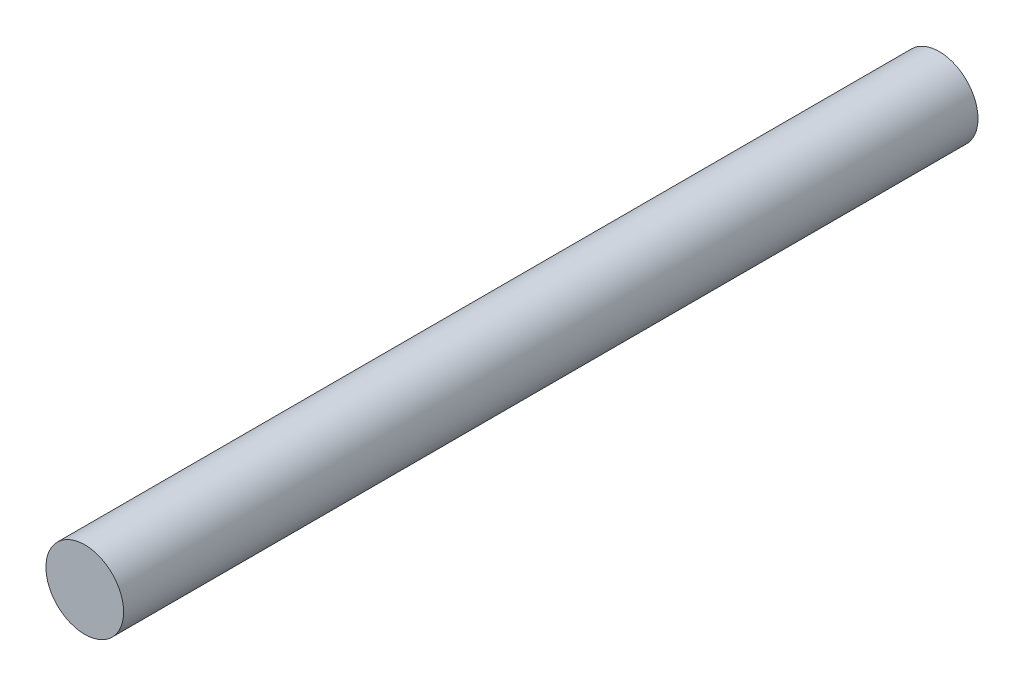
ISO-10303-21;
HEADER;
FILE_DESCRIPTION(('STEP AP214'),'2;1');
FILE_NAME('part.step','',(''),(''),'','','');
FILE_SCHEMA(('AUTOMOTIVE_DESIGN { 1 0 10303 214 1 1 1 1 }'));
ENDSEC;
DATA;
#1=APPLICATION_CONTEXT('core data for automotive mechanical design processes');
#2=APPLICATION_PROTOCOL_DEFINITION('international standard','automotive_design',2000,#1);
#3=PRODUCT_CONTEXT('',#1,'mechanical');
#4=PRODUCT('Part','Part','',(#3));
#5=PRODUCT_RELATED_PRODUCT_CATEGORY('part','',(#4));
#6=PRODUCT_DEFINITION_FORMATION('','',#4);
#7=PRODUCT_DEFINITION_CONTEXT('part definition',#1,'design');
#8=PRODUCT_DEFINITION('design','',#6,#7);
#9=PRODUCT_DEFINITION_SHAPE('','',#8);
#10=(LENGTH_UNIT() NAMED_UNIT(*) SI_UNIT(.MILLI.,.METRE.));
#11=(NAMED_UNIT(*) PLANE_ANGLE_UNIT() SI_UNIT($,.RADIAN.));
#12=(NAMED_UNIT(*) SI_UNIT($,.STERADIAN.) SOLID_ANGLE_UNIT());
#13=UNCERTAINTY_MEASURE_WITH_UNIT(LENGTH_MEASURE(1.E-05),#10,'distance_accuracy_value','');
#14=(GEOMETRIC_REPRESENTATION_CONTEXT(3) GLOBAL_UNCERTAINTY_ASSIGNED_CONTEXT((#13)) GLOBAL_UNIT_ASSIGNED_CONTEXT((#10,
#11,#12)) REPRESENTATION_CONTEXT('',''));
#15=CARTESIAN_POINT('',(0.,0.,0.));
#16=DIRECTION('',(0.,0.,1.));
#17=DIRECTION('',(1.,0.,0.));
#18=AXIS2_PLACEMENT_3D('',#15,#16,#17);
#19=CARTESIAN_POINT('',(0.,-2.03233872312052,558.8));
#20=DIRECTION('',(0.,0.,-1.));
#21=DIRECTION('',(-1.,0.,0.));
#22=AXIS2_PLACEMENT_3D('',#19,#20,#21);
#23=CYLINDRICAL_SURFACE('',#22,25.4);
#24=CARTESIAN_POINT('',(0.,-2.03233872312052,558.8));
#25=DIRECTION('',(0.,0.,1.));
#26=DIRECTION('',(1.,0.,0.));
#27=AXIS2_PLACEMENT_3D('',#24,#25,#26);
#28=CIRCLE('',#27,25.4);
#29=CARTESIAN_POINT('',(25.4,-2.03233872312052,558.8));
#30=VERTEX_POINT('',#29);
#31=EDGE_CURVE('E10',#30,#30,#28,.T.);
#32=ORIENTED_EDGE('',*,*,#31,.F.);
#33=EDGE_LOOP('',(#32));
#34=FACE_BOUND('',#33,.T.);
#35=CARTESIAN_POINT('',(0.,-2.03233872312052,0.));
#36=DIRECTION('',(0.,0.,1.));
#37=DIRECTION('',(1.,0.,0.));
#38=AXIS2_PLACEMENT_3D('',#35,#36,#37);
#39=CIRCLE('',#38,25.4);
#40=CARTESIAN_POINT('',(25.4,-2.03233872312052,0.));
#41=VERTEX_POINT('',#40);
#42=EDGE_CURVE('E40',#41,#41,#39,.T.);
#43=ORIENTED_EDGE('',*,*,#42,.T.);
#44=EDGE_LOOP('',(#43));
#45=FACE_BOUND('',#44,.T.);
#46=ADVANCED_FACE('F37',(#34,#45),#23,.T.);
#47=CARTESIAN_POINT('',(0.,-2.03233872312052,558.8));
#48=DIRECTION('',(0.,0.,1.));
#49=DIRECTION('',(1.,0.,0.));
#50=AXIS2_PLACEMENT_3D('',#47,#48,#49);
#51=PLANE('',#50);
#52=ORIENTED_EDGE('',*,*,#31,.T.);
#53=EDGE_LOOP('',(#52));
#54=FACE_BOUND('',#53,.T.);
#55=ADVANCED_FACE('F52',(#54),#51,.T.);
#56=CARTESIAN_POINT('',(0.,-2.03233872312052,0.));
#57=DIRECTION('',(0.,0.,1.));
#58=DIRECTION('',(1.,0.,0.));
#59=AXIS2_PLACEMENT_3D('',#56,#57,#58);
#60=PLANE('',#59);
#61=ORIENTED_EDGE('',*,*,#42,.F.);
#62=EDGE_LOOP('',(#61));
#63=FACE_BOUND('',#62,.T.);
#64=ADVANCED_FACE('F50',(#63),#60,.F.);
#65=CLOSED_SHELL('',(#46,#55,#64));
#66=MANIFOLD_SOLID_BREP('B2',#65);
#67=ADVANCED_BREP_SHAPE_REPRESENTATION('',(#18,#66),#14);
#68=SHAPE_DEFINITION_REPRESENTATION(#9,#67);
ENDSEC;
END-ISO-10303-21;
